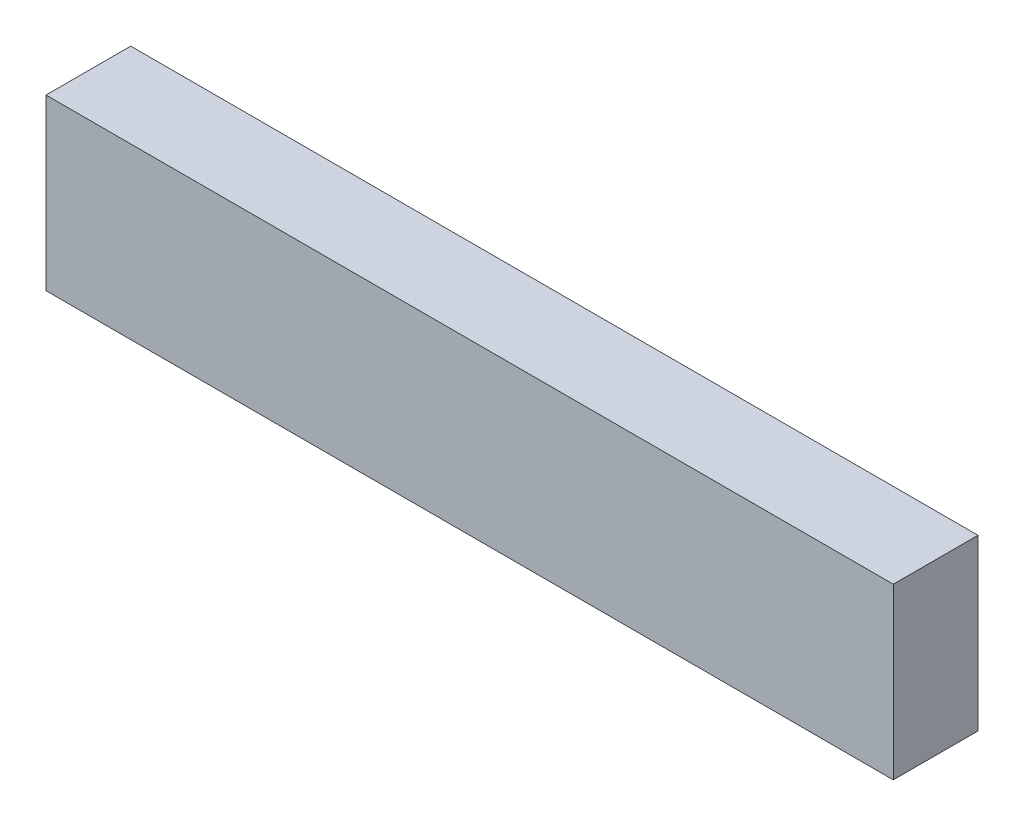
ISO-10303-21;
HEADER;
FILE_DESCRIPTION(('STEP AP214'),'2;1');
FILE_NAME('part.step','',(''),(''),'','','');
FILE_SCHEMA(('AUTOMOTIVE_DESIGN { 1 0 10303 214 1 1 1 1 }'));
ENDSEC;
DATA;
#1=APPLICATION_CONTEXT('core data for automotive mechanical design processes');
#2=APPLICATION_PROTOCOL_DEFINITION('international standard','automotive_design',2000,#1);
#3=PRODUCT_CONTEXT('',#1,'mechanical');
#4=PRODUCT('Part','Part','',(#3));
#5=PRODUCT_RELATED_PRODUCT_CATEGORY('part','',(#4));
#6=PRODUCT_DEFINITION_FORMATION('','',#4);
#7=PRODUCT_DEFINITION_CONTEXT('part definition',#1,'design');
#8=PRODUCT_DEFINITION('design','',#6,#7);
#9=PRODUCT_DEFINITION_SHAPE('','',#8);
#10=(LENGTH_UNIT() NAMED_UNIT(*) SI_UNIT(.MILLI.,.METRE.));
#11=(NAMED_UNIT(*) PLANE_ANGLE_UNIT() SI_UNIT($,.RADIAN.));
#12=(NAMED_UNIT(*) SI_UNIT($,.STERADIAN.) SOLID_ANGLE_UNIT());
#13=UNCERTAINTY_MEASURE_WITH_UNIT(LENGTH_MEASURE(1.E-05),#10,'distance_accuracy_value','');
#14=(GEOMETRIC_REPRESENTATION_CONTEXT(3) GLOBAL_UNCERTAINTY_ASSIGNED_CONTEXT((#13)) GLOBAL_UNIT_ASSIGNED_CONTEXT((#10,
#11,#12)) REPRESENTATION_CONTEXT('',''));
#15=CARTESIAN_POINT('',(0.,0.,0.));
#16=DIRECTION('',(0.,0.,1.));
#17=DIRECTION('',(1.,0.,0.));
#18=AXIS2_PLACEMENT_3D('',#15,#16,#17);
#19=CARTESIAN_POINT('',(0.,0.,10.));
#20=DIRECTION('',(1.,0.,0.));
#21=DIRECTION('',(0.,0.,-1.));
#22=AXIS2_PLACEMENT_3D('',#19,#20,#21);
#23=PLANE('',#22);
#24=DIRECTION('',(0.,-1.,0.));
#25=VECTOR('',#24,1.);
#26=CARTESIAN_POINT('',(0.,0.,0.));
#27=LINE('',#26,#25);
#28=CARTESIAN_POINT('',(0.,20.,0.));
#29=VERTEX_POINT('',#28);
#30=CARTESIAN_POINT('',(0.,0.,0.));
#31=VERTEX_POINT('',#30);
#32=EDGE_CURVE('E94',#29,#31,#27,.T.);
#33=ORIENTED_EDGE('',*,*,#32,.T.);
#34=DIRECTION('',(0.,0.,-1.));
#35=VECTOR('',#34,1.);
#36=CARTESIAN_POINT('',(0.,0.,10.));
#37=LINE('',#36,#35);
#38=CARTESIAN_POINT('',(0.,0.,10.));
#39=VERTEX_POINT('',#38);
#40=EDGE_CURVE('E11',#39,#31,#37,.T.);
#41=ORIENTED_EDGE('',*,*,#40,.F.);
#42=DIRECTION('',(0.,-1.,0.));
#43=VECTOR('',#42,1.);
#44=CARTESIAN_POINT('',(0.,0.,10.));
#45=LINE('',#44,#43);
#46=CARTESIAN_POINT('',(0.,20.,10.));
#47=VERTEX_POINT('',#46);
#48=EDGE_CURVE('E82',#47,#39,#45,.T.);
#49=ORIENTED_EDGE('',*,*,#48,.F.);
#50=DIRECTION('',(0.,0.,-1.));
#51=VECTOR('',#50,1.);
#52=CARTESIAN_POINT('',(0.,20.,10.));
#53=LINE('',#52,#51);
#54=EDGE_CURVE('E90',#47,#29,#53,.T.);
#55=ORIENTED_EDGE('',*,*,#54,.T.);
#56=EDGE_LOOP('',(#33,#41,#49,#55));
#57=FACE_BOUND('',#56,.T.);
#58=ADVANCED_FACE('F31',(#57),#23,.F.);
#59=CARTESIAN_POINT('',(0.,0.,10.));
#60=DIRECTION('',(0.,1.,0.));
#61=DIRECTION('',(0.,0.,1.));
#62=AXIS2_PLACEMENT_3D('',#59,#60,#61);
#63=PLANE('',#62);
#64=DIRECTION('',(1.,0.,0.));
#65=VECTOR('',#64,1.);
#66=CARTESIAN_POINT('',(0.,0.,0.));
#67=LINE('',#66,#65);
#68=CARTESIAN_POINT('',(100.,0.,0.));
#69=VERTEX_POINT('',#68);
#70=EDGE_CURVE('E86',#31,#69,#67,.T.);
#71=ORIENTED_EDGE('',*,*,#70,.T.);
#72=DIRECTION('',(0.,0.,-1.));
#73=VECTOR('',#72,1.);
#74=CARTESIAN_POINT('',(100.,0.,10.));
#75=LINE('',#74,#73);
#76=CARTESIAN_POINT('',(100.,0.,10.));
#77=VERTEX_POINT('',#76);
#78=EDGE_CURVE('E39',#77,#69,#75,.T.);
#79=ORIENTED_EDGE('',*,*,#78,.F.);
#80=DIRECTION('',(1.,0.,0.));
#81=VECTOR('',#80,1.);
#82=CARTESIAN_POINT('',(0.,0.,10.));
#83=LINE('',#82,#81);
#84=EDGE_CURVE('E77',#39,#77,#83,.T.);
#85=ORIENTED_EDGE('',*,*,#84,.F.);
#86=ORIENTED_EDGE('',*,*,#40,.T.);
#87=EDGE_LOOP('',(#71,#79,#85,#86));
#88=FACE_BOUND('',#87,.T.);
#89=ADVANCED_FACE('F85',(#88),#63,.F.);
#90=CARTESIAN_POINT('',(100.,0.,10.));
#91=DIRECTION('',(-1.,0.,0.));
#92=DIRECTION('',(0.,0.,1.));
#93=AXIS2_PLACEMENT_3D('',#90,#91,#92);
#94=PLANE('',#93);
#95=DIRECTION('',(0.,1.,0.));
#96=VECTOR('',#95,1.);
#97=CARTESIAN_POINT('',(100.,0.,0.));
#98=LINE('',#97,#96);
#99=CARTESIAN_POINT('',(100.,20.,0.));
#100=VERTEX_POINT('',#99);
#101=EDGE_CURVE('E64',#69,#100,#98,.T.);
#102=ORIENTED_EDGE('',*,*,#101,.T.);
#103=DIRECTION('',(0.,0.,-1.));
#104=VECTOR('',#103,1.);
#105=CARTESIAN_POINT('',(100.,20.,10.));
#106=LINE('',#105,#104);
#107=CARTESIAN_POINT('',(100.,20.,10.));
#108=VERTEX_POINT('',#107);
#109=EDGE_CURVE('E87',#108,#100,#106,.T.);
#110=ORIENTED_EDGE('',*,*,#109,.F.);
#111=DIRECTION('',(0.,1.,0.));
#112=VECTOR('',#111,1.);
#113=CARTESIAN_POINT('',(100.,0.,10.));
#114=LINE('',#113,#112);
#115=EDGE_CURVE('E80',#77,#108,#114,.T.);
#116=ORIENTED_EDGE('',*,*,#115,.F.);
#117=ORIENTED_EDGE('',*,*,#78,.T.);
#118=EDGE_LOOP('',(#102,#110,#116,#117));
#119=FACE_BOUND('',#118,.T.);
#120=ADVANCED_FACE('F88',(#119),#94,.F.);
#121=CARTESIAN_POINT('',(0.,20.,10.));
#122=DIRECTION('',(0.,-1.,0.));
#123=DIRECTION('',(0.,0.,-1.));
#124=AXIS2_PLACEMENT_3D('',#121,#122,#123);
#125=PLANE('',#124);
#126=DIRECTION('',(-1.,0.,0.));
#127=VECTOR('',#126,1.);
#128=CARTESIAN_POINT('',(0.,20.,0.));
#129=LINE('',#128,#127);
#130=EDGE_CURVE('E70',#100,#29,#129,.T.);
#131=ORIENTED_EDGE('',*,*,#130,.T.);
#132=ORIENTED_EDGE('',*,*,#54,.F.);
#133=DIRECTION('',(-1.,0.,0.));
#134=VECTOR('',#133,1.);
#135=CARTESIAN_POINT('',(0.,20.,10.));
#136=LINE('',#135,#134);
#137=EDGE_CURVE('E47',#108,#47,#136,.T.);
#138=ORIENTED_EDGE('',*,*,#137,.F.);
#139=ORIENTED_EDGE('',*,*,#109,.T.);
#140=EDGE_LOOP('',(#131,#132,#138,#139));
#141=FACE_BOUND('',#140,.T.);
#142=ADVANCED_FACE('F101',(#141),#125,.F.);
#143=CARTESIAN_POINT('',(0.,20.,10.));
#144=DIRECTION('',(0.,0.,-1.));
#145=DIRECTION('',(-1.,0.,0.));
#146=AXIS2_PLACEMENT_3D('',#143,#144,#145);
#147=PLANE('',#146);
#148=ORIENTED_EDGE('',*,*,#48,.T.);
#149=ORIENTED_EDGE('',*,*,#84,.T.);
#150=ORIENTED_EDGE('',*,*,#115,.T.);
#151=ORIENTED_EDGE('',*,*,#137,.T.);
#152=EDGE_LOOP('',(#148,#149,#150,#151));
#153=FACE_BOUND('',#152,.T.);
#154=ADVANCED_FACE('F78',(#153),#147,.F.);
#155=CARTESIAN_POINT('',(0.,20.,0.));
#156=DIRECTION('',(0.,0.,-1.));
#157=DIRECTION('',(-1.,0.,0.));
#158=AXIS2_PLACEMENT_3D('',#155,#156,#157);
#159=PLANE('',#158);
#160=ORIENTED_EDGE('',*,*,#32,.F.);
#161=ORIENTED_EDGE('',*,*,#130,.F.);
#162=ORIENTED_EDGE('',*,*,#101,.F.);
#163=ORIENTED_EDGE('',*,*,#70,.F.);
#164=EDGE_LOOP('',(#160,#161,#162,#163));
#165=FACE_BOUND('',#164,.T.);
#166=ADVANCED_FACE('F104',(#165),#159,.T.);
#167=CLOSED_SHELL('',(#58,#89,#120,#142,#154,#166));
#168=MANIFOLD_SOLID_BREP('B2',#167);
#169=ADVANCED_BREP_SHAPE_REPRESENTATION('',(#18,#168),#14);
#170=SHAPE_DEFINITION_REPRESENTATION(#9,#169);
ENDSEC;
END-ISO-10303-21;
